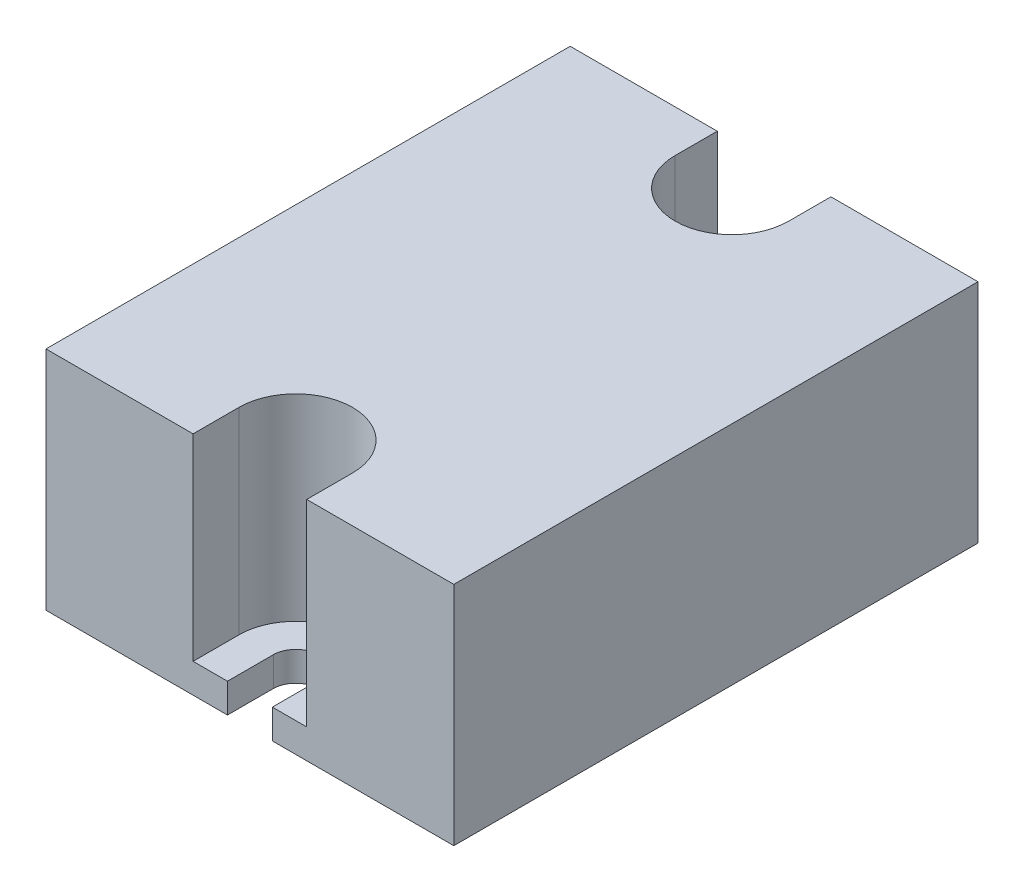
ISO-10303-21;
HEADER;
FILE_DESCRIPTION(('STEP AP214'),'2;1');
FILE_NAME('part.step','',(''),(''),'','','');
FILE_SCHEMA(('AUTOMOTIVE_DESIGN { 1 0 10303 214 1 1 1 1 }'));
ENDSEC;
DATA;
#1=APPLICATION_CONTEXT('core data for automotive mechanical design processes');
#2=APPLICATION_PROTOCOL_DEFINITION('international standard','automotive_design',2000,#1);
#3=PRODUCT_CONTEXT('',#1,'mechanical');
#4=PRODUCT('Part','Part','',(#3));
#5=PRODUCT_RELATED_PRODUCT_CATEGORY('part','',(#4));
#6=PRODUCT_DEFINITION_FORMATION('','',#4);
#7=PRODUCT_DEFINITION_CONTEXT('part definition',#1,'design');
#8=PRODUCT_DEFINITION('design','',#6,#7);
#9=PRODUCT_DEFINITION_SHAPE('','',#8);
#10=(LENGTH_UNIT() NAMED_UNIT(*) SI_UNIT(.MILLI.,.METRE.));
#11=(NAMED_UNIT(*) PLANE_ANGLE_UNIT() SI_UNIT($,.RADIAN.));
#12=(NAMED_UNIT(*) SI_UNIT($,.STERADIAN.) SOLID_ANGLE_UNIT());
#13=UNCERTAINTY_MEASURE_WITH_UNIT(LENGTH_MEASURE(1.E-05),#10,'distance_accuracy_value','');
#14=(GEOMETRIC_REPRESENTATION_CONTEXT(3) GLOBAL_UNCERTAINTY_ASSIGNED_CONTEXT((#13)) GLOBAL_UNIT_ASSIGNED_CONTEXT((#10,
#11,#12)) REPRESENTATION_CONTEXT('',''));
#15=CARTESIAN_POINT('',(0.,0.,0.));
#16=DIRECTION('',(0.,0.,1.));
#17=DIRECTION('',(1.,0.,0.));
#18=AXIS2_PLACEMENT_3D('',#15,#16,#17);
#19=CARTESIAN_POINT('',(22.25,24.7,-5.));
#20=DIRECTION('',(0.,-1.,0.));
#21=DIRECTION('',(0.,0.,-1.));
#22=AXIS2_PLACEMENT_3D('',#19,#20,#21);
#23=CYLINDRICAL_SURFACE('',#22,6.2);
#24=CARTESIAN_POINT('',(22.25,24.7,-5.));
#25=DIRECTION('',(0.,-1.,0.));
#26=DIRECTION('',(0.,0.,-1.));
#27=AXIS2_PLACEMENT_3D('',#24,#25,#26);
#28=CIRCLE('',#27,6.2);
#29=CARTESIAN_POINT('',(28.45,24.7,-5.00000000000001));
#30=VERTEX_POINT('',#29);
#31=CARTESIAN_POINT('',(16.05,24.7,-5.));
#32=VERTEX_POINT('',#31);
#33=EDGE_CURVE('E207',#30,#32,#28,.F.);
#34=ORIENTED_EDGE('',*,*,#33,.T.);
#35=DIRECTION('',(0.,1.,0.));
#36=VECTOR('',#35,1.);
#37=CARTESIAN_POINT('',(16.05,24.7,-5.));
#38=LINE('',#37,#36);
#39=CARTESIAN_POINT('',(16.05,3.2,-5.));
#40=VERTEX_POINT('',#39);
#41=EDGE_CURVE('E134',#32,#40,#38,.F.);
#42=ORIENTED_EDGE('',*,*,#41,.T.);
#43=CARTESIAN_POINT('',(22.25,3.2,-5.));
#44=DIRECTION('',(0.,-1.,0.));
#45=DIRECTION('',(0.,0.,-1.));
#46=AXIS2_PLACEMENT_3D('',#43,#44,#45);
#47=CIRCLE('',#46,6.2);
#48=CARTESIAN_POINT('',(28.45,3.2,-5.00000000000001));
#49=VERTEX_POINT('',#48);
#50=EDGE_CURVE('E20',#49,#40,#47,.F.);
#51=ORIENTED_EDGE('',*,*,#50,.F.);
#52=DIRECTION('',(0.,1.,0.));
#53=VECTOR('',#52,1.);
#54=CARTESIAN_POINT('',(28.45,24.7,-5.00000000000002));
#55=LINE('',#54,#53);
#56=EDGE_CURVE('E132',#49,#30,#55,.T.);
#57=ORIENTED_EDGE('',*,*,#56,.T.);
#58=EDGE_LOOP('',(#34,#42,#51,#57));
#59=FACE_BOUND('',#58,.T.);
#60=ADVANCED_FACE('F17',(#59),#23,.F.);
#61=CARTESIAN_POINT('',(22.25,24.7,-52.6));
#62=DIRECTION('',(0.,-1.,0.));
#63=DIRECTION('',(0.,0.,-1.));
#64=AXIS2_PLACEMENT_3D('',#61,#62,#63);
#65=CYLINDRICAL_SURFACE('',#64,6.2);
#66=DIRECTION('',(0.,1.,0.));
#67=VECTOR('',#66,1.);
#68=CARTESIAN_POINT('',(16.05,24.7,-52.6));
#69=LINE('',#68,#67);
#70=CARTESIAN_POINT('',(16.05,3.2,-52.6));
#71=VERTEX_POINT('',#70);
#72=CARTESIAN_POINT('',(16.05,24.7,-52.6));
#73=VERTEX_POINT('',#72);
#74=EDGE_CURVE('E151',#71,#73,#69,.T.);
#75=ORIENTED_EDGE('',*,*,#74,.T.);
#76=CARTESIAN_POINT('',(22.25,24.7,-52.6));
#77=DIRECTION('',(0.,-1.,0.));
#78=DIRECTION('',(0.,0.,-1.));
#79=AXIS2_PLACEMENT_3D('',#76,#77,#78);
#80=CIRCLE('',#79,6.2);
#81=CARTESIAN_POINT('',(28.45,24.7,-52.6));
#82=VERTEX_POINT('',#81);
#83=EDGE_CURVE('E209',#73,#82,#80,.F.);
#84=ORIENTED_EDGE('',*,*,#83,.T.);
#85=DIRECTION('',(0.,1.,0.));
#86=VECTOR('',#85,1.);
#87=CARTESIAN_POINT('',(28.45,24.7,-52.6));
#88=LINE('',#87,#86);
#89=CARTESIAN_POINT('',(28.45,3.2,-52.6));
#90=VERTEX_POINT('',#89);
#91=EDGE_CURVE('E148',#82,#90,#88,.F.);
#92=ORIENTED_EDGE('',*,*,#91,.T.);
#93=CARTESIAN_POINT('',(22.25,3.2,-52.6));
#94=DIRECTION('',(0.,-1.,0.));
#95=DIRECTION('',(0.,0.,-1.));
#96=AXIS2_PLACEMENT_3D('',#93,#94,#95);
#97=CIRCLE('',#96,6.2);
#98=EDGE_CURVE('E203',#71,#90,#97,.F.);
#99=ORIENTED_EDGE('',*,*,#98,.F.);
#100=EDGE_LOOP('',(#75,#84,#92,#99));
#101=FACE_BOUND('',#100,.T.);
#102=ADVANCED_FACE('F346',(#101),#65,.F.);
#103=CARTESIAN_POINT('',(16.05,24.7,0.));
#104=DIRECTION('',(-1.,0.,0.));
#105=DIRECTION('',(0.,0.,1.));
#106=AXIS2_PLACEMENT_3D('',#103,#104,#105);
#107=PLANE('',#106);
#108=ORIENTED_EDGE('',*,*,#41,.F.);
#109=DIRECTION('',(0.,0.,-1.));
#110=VECTOR('',#109,1.);
#111=CARTESIAN_POINT('',(16.05,24.7,-5.));
#112=LINE('',#111,#110);
#113=CARTESIAN_POINT('',(16.05,24.7,0.));
#114=VERTEX_POINT('',#113);
#115=EDGE_CURVE('E208',#32,#114,#112,.F.);
#116=ORIENTED_EDGE('',*,*,#115,.T.);
#117=DIRECTION('',(0.,1.,0.));
#118=VECTOR('',#117,1.);
#119=CARTESIAN_POINT('',(16.05,3.2,0.));
#120=LINE('',#119,#118);
#121=CARTESIAN_POINT('',(16.05,3.2,0.));
#122=VERTEX_POINT('',#121);
#123=EDGE_CURVE('E181',#114,#122,#120,.F.);
#124=ORIENTED_EDGE('',*,*,#123,.T.);
#125=DIRECTION('',(0.,0.,1.));
#126=VECTOR('',#125,1.);
#127=CARTESIAN_POINT('',(16.05,3.2,-5.));
#128=LINE('',#127,#126);
#129=EDGE_CURVE('E136',#40,#122,#128,.T.);
#130=ORIENTED_EDGE('',*,*,#129,.F.);
#131=EDGE_LOOP('',(#108,#116,#124,#130));
#132=FACE_BOUND('',#131,.T.);
#133=ADVANCED_FACE('F333',(#132),#107,.F.);
#134=CARTESIAN_POINT('',(22.25,3.2,-5.));
#135=DIRECTION('',(0.,1.,0.));
#136=DIRECTION('',(0.,0.,1.));
#137=AXIS2_PLACEMENT_3D('',#134,#135,#136);
#138=PLANE('',#137);
#139=DIRECTION('',(0.,0.,-1.));
#140=VECTOR('',#139,1.);
#141=CARTESIAN_POINT('',(24.7,3.2,0.));
#142=LINE('',#141,#140);
#143=CARTESIAN_POINT('',(24.7,3.2,-5.));
#144=VERTEX_POINT('',#143);
#145=CARTESIAN_POINT('',(24.7,3.2,0.));
#146=VERTEX_POINT('',#145);
#147=EDGE_CURVE('E167',#144,#146,#142,.F.);
#148=ORIENTED_EDGE('',*,*,#147,.T.);
#149=DIRECTION('',(-1.,0.,0.));
#150=VECTOR('',#149,1.);
#151=CARTESIAN_POINT('',(44.5,3.2,0.));
#152=LINE('',#151,#150);
#153=CARTESIAN_POINT('',(28.45,3.2,0.));
#154=VERTEX_POINT('',#153);
#155=EDGE_CURVE('E147',#146,#154,#152,.F.);
#156=ORIENTED_EDGE('',*,*,#155,.T.);
#157=DIRECTION('',(0.,0.,-1.));
#158=VECTOR('',#157,1.);
#159=CARTESIAN_POINT('',(28.45,3.2,0.));
#160=LINE('',#159,#158);
#161=EDGE_CURVE('E140',#154,#49,#160,.T.);
#162=ORIENTED_EDGE('',*,*,#161,.T.);
#163=ORIENTED_EDGE('',*,*,#50,.T.);
#164=ORIENTED_EDGE('',*,*,#129,.T.);
#165=DIRECTION('',(-1.,0.,0.));
#166=VECTOR('',#165,1.);
#167=CARTESIAN_POINT('',(0.,3.2,0.));
#168=LINE('',#167,#166);
#169=CARTESIAN_POINT('',(19.8,3.2,0.));
#170=VERTEX_POINT('',#169);
#171=EDGE_CURVE('E179',#122,#170,#168,.F.);
#172=ORIENTED_EDGE('',*,*,#171,.T.);
#173=DIRECTION('',(0.,0.,1.));
#174=VECTOR('',#173,1.);
#175=CARTESIAN_POINT('',(19.8,3.2,0.));
#176=LINE('',#175,#174);
#177=CARTESIAN_POINT('',(19.8,3.2,-5.));
#178=VERTEX_POINT('',#177);
#179=EDGE_CURVE('E172',#170,#178,#176,.F.);
#180=ORIENTED_EDGE('',*,*,#179,.T.);
#181=CARTESIAN_POINT('',(22.25,3.2,-5.));
#182=DIRECTION('',(0.,-1.,0.));
#183=DIRECTION('',(0.,0.,-1.));
#184=AXIS2_PLACEMENT_3D('',#181,#182,#183);
#185=CIRCLE('',#184,2.45);
#186=EDGE_CURVE('E201',#178,#144,#185,.T.);
#187=ORIENTED_EDGE('',*,*,#186,.T.);
#188=EDGE_LOOP('',(#148,#156,#162,#163,#164,#172,#180,#187));
#189=FACE_BOUND('',#188,.T.);
#190=ADVANCED_FACE('F145',(#189),#138,.T.);
#191=CARTESIAN_POINT('',(28.45,24.7,0.));
#192=DIRECTION('',(1.,0.,0.));
#193=DIRECTION('',(0.,0.,-1.));
#194=AXIS2_PLACEMENT_3D('',#191,#192,#193);
#195=PLANE('',#194);
#196=DIRECTION('',(0.,1.,0.));
#197=VECTOR('',#196,1.);
#198=CARTESIAN_POINT('',(28.45,3.2,0.));
#199=LINE('',#198,#197);
#200=CARTESIAN_POINT('',(28.45,24.7,0.));
#201=VERTEX_POINT('',#200);
#202=EDGE_CURVE('E160',#154,#201,#199,.T.);
#203=ORIENTED_EDGE('',*,*,#202,.T.);
#204=DIRECTION('',(0.,0.,-1.));
#205=VECTOR('',#204,1.);
#206=CARTESIAN_POINT('',(28.45,24.7,-5.));
#207=LINE('',#206,#205);
#208=EDGE_CURVE('E142',#201,#30,#207,.T.);
#209=ORIENTED_EDGE('',*,*,#208,.T.);
#210=ORIENTED_EDGE('',*,*,#56,.F.);
#211=ORIENTED_EDGE('',*,*,#161,.F.);
#212=EDGE_LOOP('',(#203,#209,#210,#211));
#213=FACE_BOUND('',#212,.T.);
#214=ADVANCED_FACE('F139',(#213),#195,.F.);
#215=CARTESIAN_POINT('',(28.45,24.7,-57.2));
#216=DIRECTION('',(1.,0.,0.));
#217=DIRECTION('',(0.,0.,-1.));
#218=AXIS2_PLACEMENT_3D('',#215,#216,#217);
#219=PLANE('',#218);
#220=ORIENTED_EDGE('',*,*,#91,.F.);
#221=DIRECTION('',(0.,0.,-1.));
#222=VECTOR('',#221,1.);
#223=CARTESIAN_POINT('',(28.45,24.7,-5.));
#224=LINE('',#223,#222);
#225=CARTESIAN_POINT('',(28.45,24.7,-57.2));
#226=VERTEX_POINT('',#225);
#227=EDGE_CURVE('E211',#82,#226,#224,.T.);
#228=ORIENTED_EDGE('',*,*,#227,.T.);
#229=DIRECTION('',(0.,1.,0.));
#230=VECTOR('',#229,1.);
#231=CARTESIAN_POINT('',(28.45,3.2,-57.2));
#232=LINE('',#231,#230);
#233=CARTESIAN_POINT('',(28.45,3.2,-57.2));
#234=VERTEX_POINT('',#233);
#235=EDGE_CURVE('E245',#226,#234,#232,.F.);
#236=ORIENTED_EDGE('',*,*,#235,.T.);
#237=DIRECTION('',(0.,0.,1.));
#238=VECTOR('',#237,1.);
#239=CARTESIAN_POINT('',(28.45,3.2,-5.));
#240=LINE('',#239,#238);
#241=EDGE_CURVE('E205',#90,#234,#240,.F.);
#242=ORIENTED_EDGE('',*,*,#241,.F.);
#243=EDGE_LOOP('',(#220,#228,#236,#242));
#244=FACE_BOUND('',#243,.T.);
#245=ADVANCED_FACE('F350',(#244),#219,.F.);
#246=CARTESIAN_POINT('',(16.05,24.7,-57.2));
#247=DIRECTION('',(-1.,0.,0.));
#248=DIRECTION('',(0.,0.,1.));
#249=AXIS2_PLACEMENT_3D('',#246,#247,#248);
#250=PLANE('',#249);
#251=DIRECTION('',(0.,1.,0.));
#252=VECTOR('',#251,1.);
#253=CARTESIAN_POINT('',(16.05,3.2,-57.2));
#254=LINE('',#253,#252);
#255=CARTESIAN_POINT('',(16.05,3.2,-57.2));
#256=VERTEX_POINT('',#255);
#257=CARTESIAN_POINT('',(16.05,24.7,-57.2));
#258=VERTEX_POINT('',#257);
#259=EDGE_CURVE('E230',#256,#258,#254,.T.);
#260=ORIENTED_EDGE('',*,*,#259,.T.);
#261=DIRECTION('',(0.,0.,-1.));
#262=VECTOR('',#261,1.);
#263=CARTESIAN_POINT('',(16.05,24.7,-5.));
#264=LINE('',#263,#262);
#265=EDGE_CURVE('E190',#258,#73,#264,.F.);
#266=ORIENTED_EDGE('',*,*,#265,.T.);
#267=ORIENTED_EDGE('',*,*,#74,.F.);
#268=DIRECTION('',(0.,0.,1.));
#269=VECTOR('',#268,1.);
#270=CARTESIAN_POINT('',(16.05,3.2,-5.));
#271=LINE('',#270,#269);
#272=EDGE_CURVE('E206',#256,#71,#271,.T.);
#273=ORIENTED_EDGE('',*,*,#272,.F.);
#274=EDGE_LOOP('',(#260,#266,#267,#273));
#275=FACE_BOUND('',#274,.T.);
#276=ADVANCED_FACE('F342',(#275),#250,.F.);
#277=CARTESIAN_POINT('',(22.25,24.7,-5.));
#278=DIRECTION('',(0.,-1.,0.));
#279=DIRECTION('',(0.,0.,-1.));
#280=AXIS2_PLACEMENT_3D('',#277,#278,#279);
#281=PLANE('',#280);
#282=ORIENTED_EDGE('',*,*,#115,.F.);
#283=ORIENTED_EDGE('',*,*,#33,.F.);
#284=ORIENTED_EDGE('',*,*,#208,.F.);
#285=DIRECTION('',(-1.,0.,0.));
#286=VECTOR('',#285,1.);
#287=CARTESIAN_POINT('',(44.5,24.7,0.));
#288=LINE('',#287,#286);
#289=CARTESIAN_POINT('',(44.5,24.7,0.));
#290=VERTEX_POINT('',#289);
#291=EDGE_CURVE('E274',#201,#290,#288,.F.);
#292=ORIENTED_EDGE('',*,*,#291,.T.);
#293=DIRECTION('',(0.,0.,1.));
#294=VECTOR('',#293,1.);
#295=CARTESIAN_POINT('',(44.5,24.7,0.));
#296=LINE('',#295,#294);
#297=CARTESIAN_POINT('',(44.5,24.7,-57.2));
#298=VERTEX_POINT('',#297);
#299=EDGE_CURVE('E260',#290,#298,#296,.F.);
#300=ORIENTED_EDGE('',*,*,#299,.T.);
#301=DIRECTION('',(1.,0.,0.));
#302=VECTOR('',#301,1.);
#303=CARTESIAN_POINT('',(0.,24.7,-57.2));
#304=LINE('',#303,#302);
#305=EDGE_CURVE('E250',#298,#226,#304,.F.);
#306=ORIENTED_EDGE('',*,*,#305,.T.);
#307=ORIENTED_EDGE('',*,*,#227,.F.);
#308=ORIENTED_EDGE('',*,*,#83,.F.);
#309=ORIENTED_EDGE('',*,*,#265,.F.);
#310=DIRECTION('',(1.,0.,0.));
#311=VECTOR('',#310,1.);
#312=CARTESIAN_POINT('',(0.,24.7,-57.2));
#313=LINE('',#312,#311);
#314=CARTESIAN_POINT('',(0.,24.7,-57.2));
#315=VERTEX_POINT('',#314);
#316=EDGE_CURVE('E226',#258,#315,#313,.F.);
#317=ORIENTED_EDGE('',*,*,#316,.T.);
#318=DIRECTION('',(0.,0.,-1.));
#319=VECTOR('',#318,1.);
#320=CARTESIAN_POINT('',(0.,24.7,0.));
#321=LINE('',#320,#319);
#322=CARTESIAN_POINT('',(0.,24.7,0.));
#323=VERTEX_POINT('',#322);
#324=EDGE_CURVE('E225',#315,#323,#321,.F.);
#325=ORIENTED_EDGE('',*,*,#324,.T.);
#326=DIRECTION('',(-1.,0.,0.));
#327=VECTOR('',#326,1.);
#328=CARTESIAN_POINT('',(0.,24.7,0.));
#329=LINE('',#328,#327);
#330=EDGE_CURVE('E186',#323,#114,#329,.F.);
#331=ORIENTED_EDGE('',*,*,#330,.T.);
#332=EDGE_LOOP('',(#282,#283,#284,#292,#300,#306,#307,#308,#309,#317,#325,#331));
#333=FACE_BOUND('',#332,.T.);
#334=ADVANCED_FACE('F287',(#333),#281,.F.);
#335=CARTESIAN_POINT('',(22.25,3.2,-5.));
#336=DIRECTION('',(0.,1.,0.));
#337=DIRECTION('',(0.,0.,1.));
#338=AXIS2_PLACEMENT_3D('',#335,#336,#337);
#339=PLANE('',#338);
#340=CARTESIAN_POINT('',(22.25,3.2,-52.6));
#341=DIRECTION('',(0.,-1.,0.));
#342=DIRECTION('',(0.,0.,-1.));
#343=AXIS2_PLACEMENT_3D('',#340,#341,#342);
#344=CIRCLE('',#343,2.45);
#345=CARTESIAN_POINT('',(22.25,3.2,-55.05));
#346=VERTEX_POINT('',#345);
#347=EDGE_CURVE('E196',#346,#346,#344,.T.);
#348=ORIENTED_EDGE('',*,*,#347,.T.);
#349=EDGE_LOOP('',(#348));
#350=FACE_BOUND('',#349,.T.);
#351=ORIENTED_EDGE('',*,*,#241,.T.);
#352=DIRECTION('',(1.,0.,0.));
#353=VECTOR('',#352,1.);
#354=CARTESIAN_POINT('',(0.,3.2,-57.2));
#355=LINE('',#354,#353);
#356=EDGE_CURVE('E240',#234,#256,#355,.F.);
#357=ORIENTED_EDGE('',*,*,#356,.T.);
#358=ORIENTED_EDGE('',*,*,#272,.T.);
#359=ORIENTED_EDGE('',*,*,#98,.T.);
#360=EDGE_LOOP('',(#351,#357,#358,#359));
#361=FACE_BOUND('',#360,.T.);
#362=ADVANCED_FACE('F345',(#350,#361),#339,.T.);
#363=CARTESIAN_POINT('',(0.,3.2,0.));
#364=DIRECTION('',(0.,0.,-1.));
#365=DIRECTION('',(-1.,0.,0.));
#366=AXIS2_PLACEMENT_3D('',#363,#364,#365);
#367=PLANE('',#366);
#368=DIRECTION('',(0.,1.,0.));
#369=VECTOR('',#368,1.);
#370=CARTESIAN_POINT('',(19.8,3.2,0.));
#371=LINE('',#370,#369);
#372=CARTESIAN_POINT('',(19.8,0.,0.));
#373=VERTEX_POINT('',#372);
#374=EDGE_CURVE('E176',#373,#170,#371,.T.);
#375=ORIENTED_EDGE('',*,*,#374,.T.);
#376=ORIENTED_EDGE('',*,*,#171,.F.);
#377=ORIENTED_EDGE('',*,*,#123,.F.);
#378=ORIENTED_EDGE('',*,*,#330,.F.);
#379=DIRECTION('',(0.,1.,0.));
#380=VECTOR('',#379,1.);
#381=CARTESIAN_POINT('',(0.,3.2,0.));
#382=LINE('',#381,#380);
#383=CARTESIAN_POINT('',(0.,0.,0.));
#384=VERTEX_POINT('',#383);
#385=EDGE_CURVE('E200',#323,#384,#382,.F.);
#386=ORIENTED_EDGE('',*,*,#385,.T.);
#387=DIRECTION('',(1.,0.,0.));
#388=VECTOR('',#387,1.);
#389=CARTESIAN_POINT('',(22.25,0.,0.));
#390=LINE('',#389,#388);
#391=EDGE_CURVE('E199',#384,#373,#390,.T.);
#392=ORIENTED_EDGE('',*,*,#391,.T.);
#393=EDGE_LOOP('',(#375,#376,#377,#378,#386,#392));
#394=FACE_BOUND('',#393,.T.);
#395=ADVANCED_FACE('F337',(#394),#367,.F.);
#396=CARTESIAN_POINT('',(19.8,3.2,0.));
#397=DIRECTION('',(-1.,0.,0.));
#398=DIRECTION('',(0.,0.,1.));
#399=AXIS2_PLACEMENT_3D('',#396,#397,#398);
#400=PLANE('',#399);
#401=DIRECTION('',(0.,-1.,0.));
#402=VECTOR('',#401,1.);
#403=CARTESIAN_POINT('',(19.8,3.2,-5.));
#404=LINE('',#403,#402);
#405=CARTESIAN_POINT('',(19.8,0.,-5.));
#406=VERTEX_POINT('',#405);
#407=EDGE_CURVE('E175',#406,#178,#404,.F.);
#408=ORIENTED_EDGE('',*,*,#407,.T.);
#409=ORIENTED_EDGE('',*,*,#179,.F.);
#410=ORIENTED_EDGE('',*,*,#374,.F.);
#411=DIRECTION('',(0.,0.,1.));
#412=VECTOR('',#411,1.);
#413=CARTESIAN_POINT('',(19.8,0.,-5.));
#414=LINE('',#413,#412);
#415=EDGE_CURVE('E195',#373,#406,#414,.F.);
#416=ORIENTED_EDGE('',*,*,#415,.T.);
#417=EDGE_LOOP('',(#408,#409,#410,#416));
#418=FACE_BOUND('',#417,.T.);
#419=ADVANCED_FACE('F386',(#418),#400,.F.);
#420=CARTESIAN_POINT('',(22.25,3.2,-5.));
#421=DIRECTION('',(0.,-1.,0.));
#422=DIRECTION('',(0.,0.,-1.));
#423=AXIS2_PLACEMENT_3D('',#420,#421,#422);
#424=CYLINDRICAL_SURFACE('',#423,2.45);
#425=ORIENTED_EDGE('',*,*,#186,.F.);
#426=ORIENTED_EDGE('',*,*,#407,.F.);
#427=CARTESIAN_POINT('',(22.25,0.,-5.));
#428=DIRECTION('',(0.,-1.,0.));
#429=DIRECTION('',(0.,0.,-1.));
#430=AXIS2_PLACEMENT_3D('',#427,#428,#429);
#431=CIRCLE('',#430,2.45);
#432=CARTESIAN_POINT('',(24.7,0.,-5.));
#433=VERTEX_POINT('',#432);
#434=EDGE_CURVE('E192',#406,#433,#431,.T.);
#435=ORIENTED_EDGE('',*,*,#434,.T.);
#436=DIRECTION('',(0.,1.,0.));
#437=VECTOR('',#436,1.);
#438=CARTESIAN_POINT('',(24.7,3.2,-5.));
#439=LINE('',#438,#437);
#440=EDGE_CURVE('E169',#433,#144,#439,.T.);
#441=ORIENTED_EDGE('',*,*,#440,.T.);
#442=EDGE_LOOP('',(#425,#426,#435,#441));
#443=FACE_BOUND('',#442,.T.);
#444=ADVANCED_FACE('F382',(#443),#424,.F.);
#445=CARTESIAN_POINT('',(24.7,3.2,0.));
#446=DIRECTION('',(1.,0.,0.));
#447=DIRECTION('',(0.,0.,-1.));
#448=AXIS2_PLACEMENT_3D('',#445,#446,#447);
#449=PLANE('',#448);
#450=DIRECTION('',(0.,1.,0.));
#451=VECTOR('',#450,1.);
#452=CARTESIAN_POINT('',(24.7,3.2,0.));
#453=LINE('',#452,#451);
#454=CARTESIAN_POINT('',(24.7,0.,0.));
#455=VERTEX_POINT('',#454);
#456=EDGE_CURVE('E161',#455,#146,#453,.T.);
#457=ORIENTED_EDGE('',*,*,#456,.T.);
#458=ORIENTED_EDGE('',*,*,#147,.F.);
#459=ORIENTED_EDGE('',*,*,#440,.F.);
#460=DIRECTION('',(0.,0.,1.));
#461=VECTOR('',#460,1.);
#462=CARTESIAN_POINT('',(24.7,0.,-5.));
#463=LINE('',#462,#461);
#464=EDGE_CURVE('E194',#433,#455,#463,.T.);
#465=ORIENTED_EDGE('',*,*,#464,.T.);
#466=EDGE_LOOP('',(#457,#458,#459,#465));
#467=FACE_BOUND('',#466,.T.);
#468=ADVANCED_FACE('F379',(#467),#449,.F.);
#469=CARTESIAN_POINT('',(44.5,3.2,0.));
#470=DIRECTION('',(0.,0.,-1.));
#471=DIRECTION('',(-1.,0.,0.));
#472=AXIS2_PLACEMENT_3D('',#469,#470,#471);
#473=PLANE('',#472);
#474=DIRECTION('',(0.,1.,0.));
#475=VECTOR('',#474,1.);
#476=CARTESIAN_POINT('',(44.5,3.2,0.));
#477=LINE('',#476,#475);
#478=CARTESIAN_POINT('',(44.5,0.,0.));
#479=VERTEX_POINT('',#478);
#480=EDGE_CURVE('E264',#479,#290,#477,.T.);
#481=ORIENTED_EDGE('',*,*,#480,.T.);
#482=ORIENTED_EDGE('',*,*,#291,.F.);
#483=ORIENTED_EDGE('',*,*,#202,.F.);
#484=ORIENTED_EDGE('',*,*,#155,.F.);
#485=ORIENTED_EDGE('',*,*,#456,.F.);
#486=DIRECTION('',(1.,0.,0.));
#487=VECTOR('',#486,1.);
#488=CARTESIAN_POINT('',(22.25,0.,0.));
#489=LINE('',#488,#487);
#490=EDGE_CURVE('E269',#455,#479,#489,.T.);
#491=ORIENTED_EDGE('',*,*,#490,.T.);
#492=EDGE_LOOP('',(#481,#482,#483,#484,#485,#491));
#493=FACE_BOUND('',#492,.T.);
#494=ADVANCED_FACE('F281',(#493),#473,.F.);
#495=CARTESIAN_POINT('',(44.5,3.2,0.));
#496=DIRECTION('',(-1.,0.,0.));
#497=DIRECTION('',(0.,0.,1.));
#498=AXIS2_PLACEMENT_3D('',#495,#496,#497);
#499=PLANE('',#498);
#500=DIRECTION('',(0.,1.,0.));
#501=VECTOR('',#500,1.);
#502=CARTESIAN_POINT('',(44.5,3.2,-57.2));
#503=LINE('',#502,#501);
#504=CARTESIAN_POINT('',(44.5,0.,-57.2));
#505=VERTEX_POINT('',#504);
#506=EDGE_CURVE('E255',#505,#298,#503,.T.);
#507=ORIENTED_EDGE('',*,*,#506,.T.);
#508=ORIENTED_EDGE('',*,*,#299,.F.);
#509=ORIENTED_EDGE('',*,*,#480,.F.);
#510=DIRECTION('',(0.,0.,1.));
#511=VECTOR('',#510,1.);
#512=CARTESIAN_POINT('',(44.5,0.,-5.));
#513=LINE('',#512,#511);
#514=EDGE_CURVE('E236',#479,#505,#513,.F.);
#515=ORIENTED_EDGE('',*,*,#514,.T.);
#516=EDGE_LOOP('',(#507,#508,#509,#515));
#517=FACE_BOUND('',#516,.T.);
#518=ADVANCED_FACE('F290',(#517),#499,.F.);
#519=CARTESIAN_POINT('',(0.,3.2,-57.2));
#520=DIRECTION('',(0.,0.,1.));
#521=DIRECTION('',(1.,0.,0.));
#522=AXIS2_PLACEMENT_3D('',#519,#520,#521);
#523=PLANE('',#522);
#524=DIRECTION('',(0.,1.,0.));
#525=VECTOR('',#524,1.);
#526=CARTESIAN_POINT('',(0.,3.2,-57.2));
#527=LINE('',#526,#525);
#528=CARTESIAN_POINT('',(0.,0.,-57.2));
#529=VERTEX_POINT('',#528);
#530=EDGE_CURVE('E35',#529,#315,#527,.T.);
#531=ORIENTED_EDGE('',*,*,#530,.T.);
#532=ORIENTED_EDGE('',*,*,#316,.F.);
#533=ORIENTED_EDGE('',*,*,#259,.F.);
#534=ORIENTED_EDGE('',*,*,#356,.F.);
#535=ORIENTED_EDGE('',*,*,#235,.F.);
#536=ORIENTED_EDGE('',*,*,#305,.F.);
#537=ORIENTED_EDGE('',*,*,#506,.F.);
#538=DIRECTION('',(1.,0.,0.));
#539=VECTOR('',#538,1.);
#540=CARTESIAN_POINT('',(22.25,0.,-57.2));
#541=LINE('',#540,#539);
#542=EDGE_CURVE('E233',#505,#529,#541,.F.);
#543=ORIENTED_EDGE('',*,*,#542,.T.);
#544=EDGE_LOOP('',(#531,#532,#533,#534,#535,#536,#537,#543));
#545=FACE_BOUND('',#544,.T.);
#546=ADVANCED_FACE('F294',(#545),#523,.F.);
#547=CARTESIAN_POINT('',(0.,3.2,0.));
#548=DIRECTION('',(1.,0.,0.));
#549=DIRECTION('',(0.,0.,-1.));
#550=AXIS2_PLACEMENT_3D('',#547,#548,#549);
#551=PLANE('',#550);
#552=ORIENTED_EDGE('',*,*,#385,.F.);
#553=ORIENTED_EDGE('',*,*,#324,.F.);
#554=ORIENTED_EDGE('',*,*,#530,.F.);
#555=DIRECTION('',(0.,0.,1.));
#556=VECTOR('',#555,1.);
#557=CARTESIAN_POINT('',(0.,0.,-5.));
#558=LINE('',#557,#556);
#559=EDGE_CURVE('E26',#529,#384,#558,.T.);
#560=ORIENTED_EDGE('',*,*,#559,.T.);
#561=EDGE_LOOP('',(#552,#553,#554,#560));
#562=FACE_BOUND('',#561,.T.);
#563=ADVANCED_FACE('F339',(#562),#551,.F.);
#564=CARTESIAN_POINT('',(22.25,3.2,-52.6));
#565=DIRECTION('',(0.,-1.,0.));
#566=DIRECTION('',(0.,0.,-1.));
#567=AXIS2_PLACEMENT_3D('',#564,#565,#566);
#568=CYLINDRICAL_SURFACE('',#567,2.45);
#569=CARTESIAN_POINT('',(22.25,0.,-52.6));
#570=DIRECTION('',(0.,-1.,0.));
#571=DIRECTION('',(0.,0.,-1.));
#572=AXIS2_PLACEMENT_3D('',#569,#570,#571);
#573=CIRCLE('',#572,2.45);
#574=CARTESIAN_POINT('',(22.25,0.,-55.05));
#575=VERTEX_POINT('',#574);
#576=EDGE_CURVE('E11',#575,#575,#573,.T.);
#577=ORIENTED_EDGE('',*,*,#576,.T.);
#578=EDGE_LOOP('',(#577));
#579=FACE_BOUND('',#578,.T.);
#580=ORIENTED_EDGE('',*,*,#347,.F.);
#581=EDGE_LOOP('',(#580));
#582=FACE_BOUND('',#581,.T.);
#583=ADVANCED_FACE('F361',(#579,#582),#568,.F.);
#584=CARTESIAN_POINT('',(22.25,0.,-5.));
#585=DIRECTION('',(0.,1.,0.));
#586=DIRECTION('',(0.,0.,1.));
#587=AXIS2_PLACEMENT_3D('',#584,#585,#586);
#588=PLANE('',#587);
#589=ORIENTED_EDGE('',*,*,#576,.F.);
#590=EDGE_LOOP('',(#589));
#591=FACE_BOUND('',#590,.T.);
#592=ORIENTED_EDGE('',*,*,#542,.F.);
#593=ORIENTED_EDGE('',*,*,#514,.F.);
#594=ORIENTED_EDGE('',*,*,#490,.F.);
#595=ORIENTED_EDGE('',*,*,#464,.F.);
#596=ORIENTED_EDGE('',*,*,#434,.F.);
#597=ORIENTED_EDGE('',*,*,#415,.F.);
#598=ORIENTED_EDGE('',*,*,#391,.F.);
#599=ORIENTED_EDGE('',*,*,#559,.F.);
#600=EDGE_LOOP('',(#592,#593,#594,#595,#596,#597,#598,#599));
#601=FACE_BOUND('',#600,.T.);
#602=ADVANCED_FACE('F297',(#591,#601),#588,.F.);
#603=CLOSED_SHELL('',(#60,#102,#133,#190,#214,#245,#276,#334,#362,#395,#419,#444,#468,#494,#518,
#546,#563,#583,#602));
#604=MANIFOLD_SOLID_BREP('B1',#603);
#605=ADVANCED_BREP_SHAPE_REPRESENTATION('',(#18,#604),#14);
#606=SHAPE_DEFINITION_REPRESENTATION(#9,#605);
ENDSEC;
END-ISO-10303-21;
